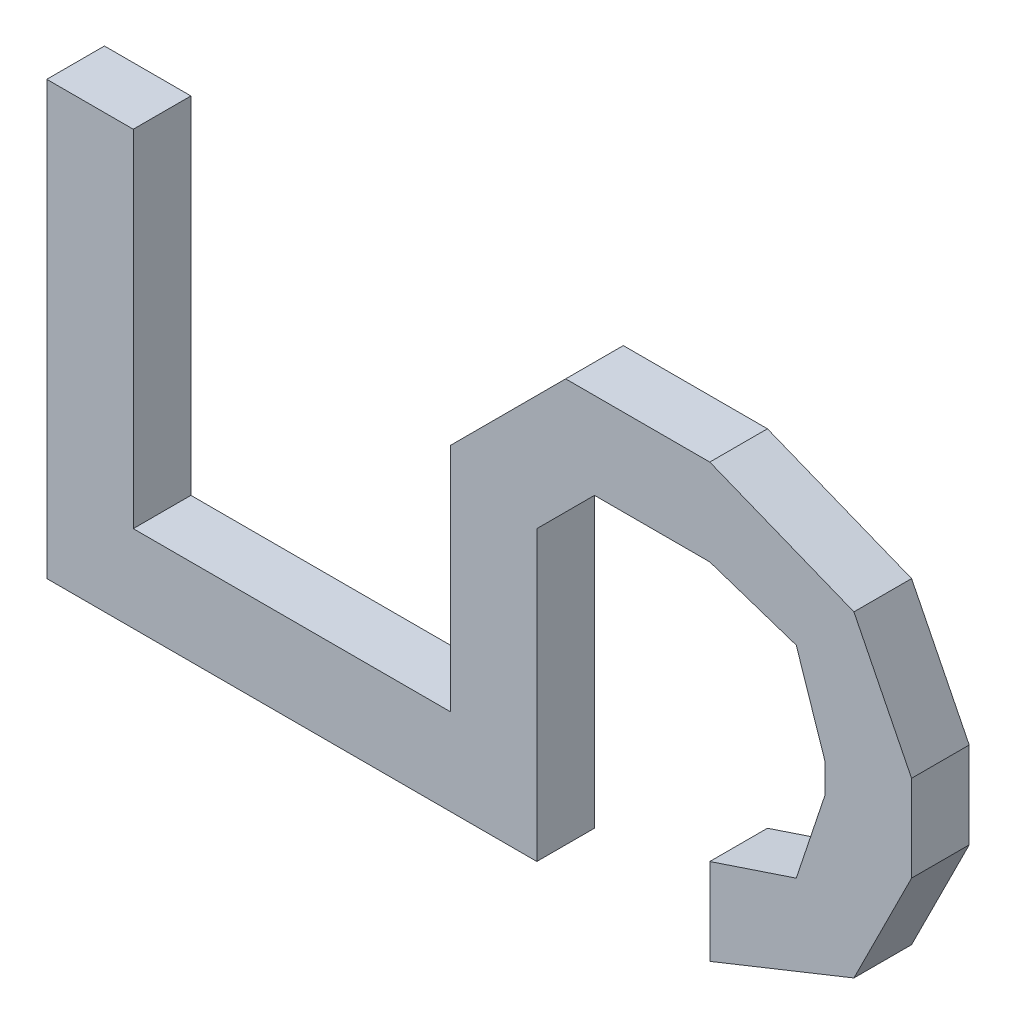
ISO-10303-21;
HEADER;
FILE_DESCRIPTION(('STEP AP214'),'2;1');
FILE_NAME('part.step','',(''),(''),'','','');
FILE_SCHEMA(('AUTOMOTIVE_DESIGN { 1 0 10303 214 1 1 1 1 }'));
ENDSEC;
DATA;
#1=APPLICATION_CONTEXT('core data for automotive mechanical design processes');
#2=APPLICATION_PROTOCOL_DEFINITION('international standard','automotive_design',2000,#1);
#3=PRODUCT_CONTEXT('',#1,'mechanical');
#4=PRODUCT('Part','Part','',(#3));
#5=PRODUCT_RELATED_PRODUCT_CATEGORY('part','',(#4));
#6=PRODUCT_DEFINITION_FORMATION('','',#4);
#7=PRODUCT_DEFINITION_CONTEXT('part definition',#1,'design');
#8=PRODUCT_DEFINITION('design','',#6,#7);
#9=PRODUCT_DEFINITION_SHAPE('','',#8);
#10=(LENGTH_UNIT() NAMED_UNIT(*) SI_UNIT(.MILLI.,.METRE.));
#11=(NAMED_UNIT(*) PLANE_ANGLE_UNIT() SI_UNIT($,.RADIAN.));
#12=(NAMED_UNIT(*) SI_UNIT($,.STERADIAN.) SOLID_ANGLE_UNIT());
#13=UNCERTAINTY_MEASURE_WITH_UNIT(LENGTH_MEASURE(1.E-05),#10,'distance_accuracy_value','');
#14=(GEOMETRIC_REPRESENTATION_CONTEXT(3) GLOBAL_UNCERTAINTY_ASSIGNED_CONTEXT((#13)) GLOBAL_UNIT_ASSIGNED_CONTEXT((#10,
#11,#12)) REPRESENTATION_CONTEXT('',''));
#15=CARTESIAN_POINT('',(0.,0.,0.));
#16=DIRECTION('',(0.,0.,1.));
#17=DIRECTION('',(1.,0.,0.));
#18=AXIS2_PLACEMENT_3D('',#15,#16,#17);
#19=CARTESIAN_POINT('',(-0.1524,0.09524999999999,0.0254));
#20=DIRECTION('',(0.,0.,-1.));
#21=DIRECTION('',(-1.,0.,0.));
#22=AXIS2_PLACEMENT_3D('',#19,#20,#21);
#23=PLANE('',#22);
#24=DIRECTION('',(0.,1.,0.));
#25=VECTOR('',#24,1.);
#26=CARTESIAN_POINT('',(-0.1905,0.09524999999999,0.0254));
#27=LINE('',#26,#25);
#28=CARTESIAN_POINT('',(-0.1905,0.09524999999999,0.0254));
#29=VERTEX_POINT('',#28);
#30=CARTESIAN_POINT('',(-0.1905,-0.09524999999999,0.0254));
#31=VERTEX_POINT('',#30);
#32=EDGE_CURVE('E256',#29,#31,#27,.F.);
#33=ORIENTED_EDGE('',*,*,#32,.T.);
#34=DIRECTION('',(1.,0.,0.));
#35=VECTOR('',#34,1.);
#36=CARTESIAN_POINT('',(-0.1905,-0.09524999999999,0.0254));
#37=LINE('',#36,#35);
#38=CARTESIAN_POINT('',(0.0254,-0.09524999999999,0.0254));
#39=VERTEX_POINT('',#38);
#40=EDGE_CURVE('E252',#31,#39,#37,.T.);
#41=ORIENTED_EDGE('',*,*,#40,.T.);
#42=DIRECTION('',(0.,1.,0.));
#43=VECTOR('',#42,1.);
#44=CARTESIAN_POINT('',(0.0254,-0.09524999999999,0.0254));
#45=LINE('',#44,#43);
#46=CARTESIAN_POINT('',(0.0254,0.03174999999999,0.0254));
#47=VERTEX_POINT('',#46);
#48=EDGE_CURVE('E248',#39,#47,#45,.T.);
#49=ORIENTED_EDGE('',*,*,#48,.T.);
#50=DIRECTION('',(-0.707106781186048,-0.707106781187048,0.));
#51=VECTOR('',#50,1.);
#52=CARTESIAN_POINT('',(0.0254,0.03174999999999,0.0254));
#53=LINE('',#52,#51);
#54=CARTESIAN_POINT('',(0.0507999999999981,0.057150000000012,0.0254));
#55=VERTEX_POINT('',#54);
#56=EDGE_CURVE('E244',#47,#55,#53,.F.);
#57=ORIENTED_EDGE('',*,*,#56,.T.);
#58=DIRECTION('',(1.,0.,0.));
#59=VECTOR('',#58,1.);
#60=CARTESIAN_POINT('',(0.0508,0.05715000000001,0.0254));
#61=LINE('',#60,#59);
#62=CARTESIAN_POINT('',(0.1016,0.05715000000001,0.0254));
#63=VERTEX_POINT('',#62);
#64=EDGE_CURVE('E240',#55,#63,#61,.T.);
#65=ORIENTED_EDGE('',*,*,#64,.T.);
#66=DIRECTION('',(-0.948683298050514,0.316227766016838,0.));
#67=VECTOR('',#66,1.);
#68=CARTESIAN_POINT('',(0.1016,0.05715000000001,0.0254));
#69=LINE('',#68,#67);
#70=CARTESIAN_POINT('',(0.1397,0.04445000000001,0.0254));
#71=VERTEX_POINT('',#70);
#72=EDGE_CURVE('E236',#63,#71,#69,.F.);
#73=ORIENTED_EDGE('',*,*,#72,.T.);
#74=DIRECTION('',(-0.316227766016838,0.948683298050514,0.));
#75=VECTOR('',#74,1.);
#76=CARTESIAN_POINT('',(0.1397,0.04445000000001,0.0254));
#77=LINE('',#76,#75);
#78=CARTESIAN_POINT('',(0.152400000000001,0.00634999999999823,0.0254));
#79=VERTEX_POINT('',#78);
#80=EDGE_CURVE('E232',#71,#79,#77,.F.);
#81=ORIENTED_EDGE('',*,*,#80,.T.);
#82=DIRECTION('',(0.,1.,0.));
#83=VECTOR('',#82,1.);
#84=CARTESIAN_POINT('',(0.1524,0.006349999999998,0.0254));
#85=LINE('',#84,#83);
#86=CARTESIAN_POINT('',(0.1524,-0.00634999999999801,0.0254));
#87=VERTEX_POINT('',#86);
#88=EDGE_CURVE('E228',#79,#87,#85,.F.);
#89=ORIENTED_EDGE('',*,*,#88,.T.);
#90=DIRECTION('',(0.316227766016838,0.948683298050514,0.));
#91=VECTOR('',#90,1.);
#92=CARTESIAN_POINT('',(0.1524,-0.006349999999998,0.0254));
#93=LINE('',#92,#91);
#94=CARTESIAN_POINT('',(0.139699999999999,-0.0444500000000097,0.0254));
#95=VERTEX_POINT('',#94);
#96=EDGE_CURVE('E224',#87,#95,#93,.F.);
#97=ORIENTED_EDGE('',*,*,#96,.T.);
#98=DIRECTION('',(0.948683298050514,0.316227766016838,0.));
#99=VECTOR('',#98,1.);
#100=CARTESIAN_POINT('',(0.1397,-0.04445000000001,0.0254));
#101=LINE('',#100,#99);
#102=CARTESIAN_POINT('',(0.1016,-0.05715000000001,0.0254));
#103=VERTEX_POINT('',#102);
#104=EDGE_CURVE('E220',#95,#103,#101,.F.);
#105=ORIENTED_EDGE('',*,*,#104,.T.);
#106=DIRECTION('',(0.,1.,0.));
#107=VECTOR('',#106,1.);
#108=CARTESIAN_POINT('',(0.1016,-0.05715000000001,0.0254));
#109=LINE('',#108,#107);
#110=CARTESIAN_POINT('',(0.1016,-0.09524999999999,0.0254));
#111=VERTEX_POINT('',#110);
#112=EDGE_CURVE('E216',#103,#111,#109,.F.);
#113=ORIENTED_EDGE('',*,*,#112,.T.);
#114=DIRECTION('',(-0.928476690885259,-0.371390676354104,0.));
#115=VECTOR('',#114,1.);
#116=CARTESIAN_POINT('',(0.1016,-0.09524999999999,0.0254));
#117=LINE('',#116,#115);
#118=CARTESIAN_POINT('',(0.165099999999999,-0.0698499999999978,0.0254));
#119=VERTEX_POINT('',#118);
#120=EDGE_CURVE('E212',#111,#119,#117,.F.);
#121=ORIENTED_EDGE('',*,*,#120,.T.);
#122=DIRECTION('',(-0.447213595499958,-0.894427190999916,0.));
#123=VECTOR('',#122,1.);
#124=CARTESIAN_POINT('',(0.1651,-0.06985,0.0254));
#125=LINE('',#124,#123);
#126=CARTESIAN_POINT('',(0.190500000000001,-0.0190499999999905,0.0254));
#127=VERTEX_POINT('',#126);
#128=EDGE_CURVE('E208',#119,#127,#125,.F.);
#129=ORIENTED_EDGE('',*,*,#128,.T.);
#130=DIRECTION('',(0.,1.,0.));
#131=VECTOR('',#130,1.);
#132=CARTESIAN_POINT('',(0.1905,-0.01904999999999,0.0254));
#133=LINE('',#132,#131);
#134=CARTESIAN_POINT('',(0.1905,0.01904999999999,0.0254));
#135=VERTEX_POINT('',#134);
#136=EDGE_CURVE('E204',#127,#135,#133,.T.);
#137=ORIENTED_EDGE('',*,*,#136,.T.);
#138=DIRECTION('',(0.447213595499958,-0.894427190999916,0.));
#139=VECTOR('',#138,1.);
#140=CARTESIAN_POINT('',(0.1905,0.01904999999999,0.0254));
#141=LINE('',#140,#139);
#142=CARTESIAN_POINT('',(0.165099999999999,0.0698499999999995,0.0254));
#143=VERTEX_POINT('',#142);
#144=EDGE_CURVE('E200',#135,#143,#141,.F.);
#145=ORIENTED_EDGE('',*,*,#144,.T.);
#146=DIRECTION('',(0.928476690885259,-0.371390676354104,0.));
#147=VECTOR('',#146,1.);
#148=CARTESIAN_POINT('',(0.1651,0.06985,0.0254));
#149=LINE('',#148,#147);
#150=CARTESIAN_POINT('',(0.101600000000001,0.0952499999999922,0.0254));
#151=VERTEX_POINT('',#150);
#152=EDGE_CURVE('E196',#143,#151,#149,.F.);
#153=ORIENTED_EDGE('',*,*,#152,.T.);
#154=DIRECTION('',(1.,0.,0.));
#155=VECTOR('',#154,1.);
#156=CARTESIAN_POINT('',(0.1016,0.09524999999999,0.0254));
#157=LINE('',#156,#155);
#158=CARTESIAN_POINT('',(0.0381,0.09524999999999,0.0254));
#159=VERTEX_POINT('',#158);
#160=EDGE_CURVE('E192',#151,#159,#157,.F.);
#161=ORIENTED_EDGE('',*,*,#160,.T.);
#162=DIRECTION('',(0.707106781187048,0.707106781186048,0.));
#163=VECTOR('',#162,1.);
#164=CARTESIAN_POINT('',(0.0381,0.09524999999999,0.0254));
#165=LINE('',#164,#163);
#166=CARTESIAN_POINT('',(-0.0127000000000065,0.0444500000000165,0.0254));
#167=VERTEX_POINT('',#166);
#168=EDGE_CURVE('E188',#159,#167,#165,.F.);
#169=ORIENTED_EDGE('',*,*,#168,.T.);
#170=DIRECTION('',(0.,1.,0.));
#171=VECTOR('',#170,1.);
#172=CARTESIAN_POINT('',(-0.0127,0.04445000000001,0.0254));
#173=LINE('',#172,#171);
#174=CARTESIAN_POINT('',(-0.0127,-0.05715000000001,0.0254));
#175=VERTEX_POINT('',#174);
#176=EDGE_CURVE('E164',#167,#175,#173,.F.);
#177=ORIENTED_EDGE('',*,*,#176,.T.);
#178=DIRECTION('',(1.,0.,0.));
#179=VECTOR('',#178,1.);
#180=CARTESIAN_POINT('',(-0.0127,-0.05715000000001,0.0254));
#181=LINE('',#180,#179);
#182=CARTESIAN_POINT('',(-0.1524,-0.05715000000001,0.0254));
#183=VERTEX_POINT('',#182);
#184=EDGE_CURVE('E166',#175,#183,#181,.F.);
#185=ORIENTED_EDGE('',*,*,#184,.T.);
#186=DIRECTION('',(0.,1.,0.));
#187=VECTOR('',#186,1.);
#188=CARTESIAN_POINT('',(-0.1524,-0.05715000000001,0.0254));
#189=LINE('',#188,#187);
#190=CARTESIAN_POINT('',(-0.1524,0.09524999999999,0.0254));
#191=VERTEX_POINT('',#190);
#192=EDGE_CURVE('E20',#183,#191,#189,.T.);
#193=ORIENTED_EDGE('',*,*,#192,.T.);
#194=DIRECTION('',(1.,0.,0.));
#195=VECTOR('',#194,1.);
#196=CARTESIAN_POINT('',(-0.1524,0.09524999999999,0.0254));
#197=LINE('',#196,#195);
#198=EDGE_CURVE('E261',#191,#29,#197,.F.);
#199=ORIENTED_EDGE('',*,*,#198,.T.);
#200=EDGE_LOOP('',(#33,#41,#49,#57,#65,#73,#81,#89,#97,#105,#113,#121,#129,#137,#145,#153,#161,
#169,#177,#185,#193,#199));
#201=FACE_BOUND('',#200,.T.);
#202=ADVANCED_FACE('F17',(#201),#23,.F.);
#203=CARTESIAN_POINT('',(-0.1524,-0.05715000000001,0.));
#204=DIRECTION('',(-1.,0.,0.));
#205=DIRECTION('',(0.,0.,1.));
#206=AXIS2_PLACEMENT_3D('',#203,#204,#205);
#207=PLANE('',#206);
#208=DIRECTION('',(0.,0.,-1.));
#209=VECTOR('',#208,1.);
#210=CARTESIAN_POINT('',(-0.1524,0.09524999999999,0.));
#211=LINE('',#210,#209);
#212=CARTESIAN_POINT('',(-0.1524,0.09524999999999,0.));
#213=VERTEX_POINT('',#212);
#214=EDGE_CURVE('E177',#213,#191,#211,.F.);
#215=ORIENTED_EDGE('',*,*,#214,.T.);
#216=ORIENTED_EDGE('',*,*,#192,.F.);
#217=DIRECTION('',(0.,0.,-1.));
#218=VECTOR('',#217,1.);
#219=CARTESIAN_POINT('',(-0.1524,-0.05715000000001,0.));
#220=LINE('',#219,#218);
#221=CARTESIAN_POINT('',(-0.1524,-0.05715000000001,0.));
#222=VERTEX_POINT('',#221);
#223=EDGE_CURVE('E172',#183,#222,#220,.T.);
#224=ORIENTED_EDGE('',*,*,#223,.T.);
#225=DIRECTION('',(0.,1.,0.));
#226=VECTOR('',#225,1.);
#227=CARTESIAN_POINT('',(-0.1524,0.09524999999999,0.));
#228=LINE('',#227,#226);
#229=EDGE_CURVE('E264',#213,#222,#228,.F.);
#230=ORIENTED_EDGE('',*,*,#229,.F.);
#231=EDGE_LOOP('',(#215,#216,#224,#230));
#232=FACE_BOUND('',#231,.T.);
#233=ADVANCED_FACE('F174',(#232),#207,.F.);
#234=CARTESIAN_POINT('',(-0.0127,-0.05715000000001,0.));
#235=DIRECTION('',(0.,-1.,0.));
#236=DIRECTION('',(0.,0.,-1.));
#237=AXIS2_PLACEMENT_3D('',#234,#235,#236);
#238=PLANE('',#237);
#239=ORIENTED_EDGE('',*,*,#223,.F.);
#240=ORIENTED_EDGE('',*,*,#184,.F.);
#241=DIRECTION('',(0.,0.,-1.));
#242=VECTOR('',#241,1.);
#243=CARTESIAN_POINT('',(-0.0127,-0.05715000000001,0.));
#244=LINE('',#243,#242);
#245=CARTESIAN_POINT('',(-0.0127,-0.05715000000001,0.));
#246=VERTEX_POINT('',#245);
#247=EDGE_CURVE('E184',#175,#246,#244,.T.);
#248=ORIENTED_EDGE('',*,*,#247,.T.);
#249=DIRECTION('',(-1.,0.,0.));
#250=VECTOR('',#249,1.);
#251=CARTESIAN_POINT('',(-0.1524,-0.05715000000001,0.));
#252=LINE('',#251,#250);
#253=EDGE_CURVE('E181',#222,#246,#252,.F.);
#254=ORIENTED_EDGE('',*,*,#253,.F.);
#255=EDGE_LOOP('',(#239,#240,#248,#254));
#256=FACE_BOUND('',#255,.T.);
#257=ADVANCED_FACE('F179',(#256),#238,.F.);
#258=CARTESIAN_POINT('',(-0.0127,0.04445000000001,0.));
#259=DIRECTION('',(1.,0.,0.));
#260=DIRECTION('',(0.,0.,-1.));
#261=AXIS2_PLACEMENT_3D('',#258,#259,#260);
#262=PLANE('',#261);
#263=ORIENTED_EDGE('',*,*,#247,.F.);
#264=ORIENTED_EDGE('',*,*,#176,.F.);
#265=DIRECTION('',(0.,0.,1.));
#266=VECTOR('',#265,1.);
#267=CARTESIAN_POINT('',(-0.0127000000000259,0.0444500000000359,0.));
#268=LINE('',#267,#266);
#269=CARTESIAN_POINT('',(-0.0127000000000065,0.0444500000000165,0.));
#270=VERTEX_POINT('',#269);
#271=EDGE_CURVE('E190',#167,#270,#268,.F.);
#272=ORIENTED_EDGE('',*,*,#271,.T.);
#273=DIRECTION('',(0.,1.,0.));
#274=VECTOR('',#273,1.);
#275=CARTESIAN_POINT('',(-0.0127,0.09524999999999,0.));
#276=LINE('',#275,#274);
#277=EDGE_CURVE('E267',#246,#270,#276,.T.);
#278=ORIENTED_EDGE('',*,*,#277,.F.);
#279=EDGE_LOOP('',(#263,#264,#272,#278));
#280=FACE_BOUND('',#279,.T.);
#281=ADVANCED_FACE('F412',(#280),#262,.F.);
#282=CARTESIAN_POINT('',(0.0381,0.09524999999999,0.));
#283=DIRECTION('',(0.707106781186048,-0.707106781187048,0.));
#284=DIRECTION('',(0.707106781187048,0.707106781186048,0.));
#285=AXIS2_PLACEMENT_3D('',#282,#283,#284);
#286=PLANE('',#285);
#287=ORIENTED_EDGE('',*,*,#271,.F.);
#288=ORIENTED_EDGE('',*,*,#168,.F.);
#289=DIRECTION('',(0.,0.,-1.));
#290=VECTOR('',#289,1.);
#291=CARTESIAN_POINT('',(0.0381,0.09524999999999,0.));
#292=LINE('',#291,#290);
#293=CARTESIAN_POINT('',(0.0381,0.09524999999999,0.));
#294=VERTEX_POINT('',#293);
#295=EDGE_CURVE('E194',#159,#294,#292,.T.);
#296=ORIENTED_EDGE('',*,*,#295,.T.);
#297=DIRECTION('',(0.707106781186687,0.707106781186408,0.));
#298=VECTOR('',#297,1.);
#299=CARTESIAN_POINT('',(-0.0127,0.04445000000001,0.));
#300=LINE('',#299,#298);
#301=EDGE_CURVE('E270',#270,#294,#300,.T.);
#302=ORIENTED_EDGE('',*,*,#301,.F.);
#303=EDGE_LOOP('',(#287,#288,#296,#302));
#304=FACE_BOUND('',#303,.T.);
#305=ADVANCED_FACE('F410',(#304),#286,.F.);
#306=CARTESIAN_POINT('',(0.1016,0.09524999999999,0.));
#307=DIRECTION('',(0.,-1.,0.));
#308=DIRECTION('',(0.,0.,-1.));
#309=AXIS2_PLACEMENT_3D('',#306,#307,#308);
#310=PLANE('',#309);
#311=ORIENTED_EDGE('',*,*,#295,.F.);
#312=ORIENTED_EDGE('',*,*,#160,.F.);
#313=DIRECTION('',(0.,0.,1.));
#314=VECTOR('',#313,1.);
#315=CARTESIAN_POINT('',(0.101600000000003,0.0952499999999986,0.));
#316=LINE('',#315,#314);
#317=CARTESIAN_POINT('',(0.101600000000001,0.0952499999999921,0.));
#318=VERTEX_POINT('',#317);
#319=EDGE_CURVE('E198',#151,#318,#316,.F.);
#320=ORIENTED_EDGE('',*,*,#319,.T.);
#321=DIRECTION('',(-1.,0.,0.));
#322=VECTOR('',#321,1.);
#323=CARTESIAN_POINT('',(-0.1524,0.09524999999999,0.));
#324=LINE('',#323,#322);
#325=EDGE_CURVE('E273',#294,#318,#324,.F.);
#326=ORIENTED_EDGE('',*,*,#325,.F.);
#327=EDGE_LOOP('',(#311,#312,#320,#326));
#328=FACE_BOUND('',#327,.T.);
#329=ADVANCED_FACE('F405',(#328),#310,.F.);
#330=CARTESIAN_POINT('',(0.1651,0.06985,0.));
#331=DIRECTION('',(-0.371390676354104,-0.928476690885259,0.));
#332=DIRECTION('',(0.928476690885259,-0.371390676354104,0.));
#333=AXIS2_PLACEMENT_3D('',#330,#331,#332);
#334=PLANE('',#333);
#335=ORIENTED_EDGE('',*,*,#319,.F.);
#336=ORIENTED_EDGE('',*,*,#152,.F.);
#337=DIRECTION('',(0.,0.,1.));
#338=VECTOR('',#337,1.);
#339=CARTESIAN_POINT('',(0.165099999999996,0.069849999999998,0.));
#340=LINE('',#339,#338);
#341=CARTESIAN_POINT('',(0.165099999999999,0.0698499999999995,0.));
#342=VERTEX_POINT('',#341);
#343=EDGE_CURVE('E202',#143,#342,#340,.F.);
#344=ORIENTED_EDGE('',*,*,#343,.T.);
#345=DIRECTION('',(0.92847669088531,-0.371390676353978,0.));
#346=VECTOR('',#345,1.);
#347=CARTESIAN_POINT('',(0.1016,0.09524999999999,0.));
#348=LINE('',#347,#346);
#349=EDGE_CURVE('E276',#318,#342,#348,.T.);
#350=ORIENTED_EDGE('',*,*,#349,.F.);
#351=EDGE_LOOP('',(#335,#336,#344,#350));
#352=FACE_BOUND('',#351,.T.);
#353=ADVANCED_FACE('F400',(#352),#334,.F.);
#354=CARTESIAN_POINT('',(0.1905,0.01904999999999,0.));
#355=DIRECTION('',(-0.894427190999916,-0.447213595499958,0.));
#356=DIRECTION('',(0.447213595499958,-0.894427190999916,0.));
#357=AXIS2_PLACEMENT_3D('',#354,#355,#356);
#358=PLANE('',#357);
#359=ORIENTED_EDGE('',*,*,#343,.F.);
#360=ORIENTED_EDGE('',*,*,#144,.F.);
#361=DIRECTION('',(0.,0.,1.));
#362=VECTOR('',#361,1.);
#363=CARTESIAN_POINT('',(0.1905,0.01904999999999,0.));
#364=LINE('',#363,#362);
#365=CARTESIAN_POINT('',(0.1905,0.01904999999999,0.));
#366=VERTEX_POINT('',#365);
#367=EDGE_CURVE('E206',#135,#366,#364,.F.);
#368=ORIENTED_EDGE('',*,*,#367,.T.);
#369=DIRECTION('',(0.447213595499888,-0.894427190999951,0.));
#370=VECTOR('',#369,1.);
#371=CARTESIAN_POINT('',(0.1651,0.06985,0.));
#372=LINE('',#371,#370);
#373=EDGE_CURVE('E279',#342,#366,#372,.T.);
#374=ORIENTED_EDGE('',*,*,#373,.F.);
#375=EDGE_LOOP('',(#359,#360,#368,#374));
#376=FACE_BOUND('',#375,.T.);
#377=ADVANCED_FACE('F395',(#376),#358,.F.);
#378=CARTESIAN_POINT('',(0.1905,-0.01904999999999,0.));
#379=DIRECTION('',(-1.,0.,0.));
#380=DIRECTION('',(0.,0.,1.));
#381=AXIS2_PLACEMENT_3D('',#378,#379,#380);
#382=PLANE('',#381);
#383=ORIENTED_EDGE('',*,*,#367,.F.);
#384=ORIENTED_EDGE('',*,*,#136,.F.);
#385=DIRECTION('',(0.,0.,1.));
#386=VECTOR('',#385,1.);
#387=CARTESIAN_POINT('',(0.190500000000004,-0.019049999999992,0.));
#388=LINE('',#387,#386);
#389=CARTESIAN_POINT('',(0.190500000000001,-0.0190499999999905,0.));
#390=VERTEX_POINT('',#389);
#391=EDGE_CURVE('E210',#127,#390,#388,.F.);
#392=ORIENTED_EDGE('',*,*,#391,.T.);
#393=DIRECTION('',(0.,1.,0.));
#394=VECTOR('',#393,1.);
#395=CARTESIAN_POINT('',(0.1905,0.09524999999999,0.));
#396=LINE('',#395,#394);
#397=EDGE_CURVE('E282',#366,#390,#396,.F.);
#398=ORIENTED_EDGE('',*,*,#397,.F.);
#399=EDGE_LOOP('',(#383,#384,#392,#398));
#400=FACE_BOUND('',#399,.T.);
#401=ADVANCED_FACE('F390',(#400),#382,.F.);
#402=CARTESIAN_POINT('',(0.1651,-0.06985,0.));
#403=DIRECTION('',(-0.894427190999916,0.447213595499958,0.));
#404=DIRECTION('',(-0.447213595499958,-0.894427190999916,0.));
#405=AXIS2_PLACEMENT_3D('',#402,#403,#404);
#406=PLANE('',#405);
#407=ORIENTED_EDGE('',*,*,#391,.F.);
#408=ORIENTED_EDGE('',*,*,#128,.F.);
#409=DIRECTION('',(0.,0.,1.));
#410=VECTOR('',#409,1.);
#411=CARTESIAN_POINT('',(0.165099999999997,-0.0698499999999914,0.));
#412=LINE('',#411,#410);
#413=CARTESIAN_POINT('',(0.165099999999999,-0.0698499999999978,0.));
#414=VERTEX_POINT('',#413);
#415=EDGE_CURVE('E214',#119,#414,#412,.F.);
#416=ORIENTED_EDGE('',*,*,#415,.T.);
#417=DIRECTION('',(-0.447213595499888,-0.894427190999951,0.));
#418=VECTOR('',#417,1.);
#419=CARTESIAN_POINT('',(0.1905,-0.01904999999999,0.));
#420=LINE('',#419,#418);
#421=EDGE_CURVE('E285',#390,#414,#420,.T.);
#422=ORIENTED_EDGE('',*,*,#421,.F.);
#423=EDGE_LOOP('',(#407,#408,#416,#422));
#424=FACE_BOUND('',#423,.T.);
#425=ADVANCED_FACE('F385',(#424),#406,.F.);
#426=CARTESIAN_POINT('',(0.1016,-0.09524999999999,0.));
#427=DIRECTION('',(-0.371390676354104,0.928476690885259,0.));
#428=DIRECTION('',(-0.928476690885259,-0.371390676354104,0.));
#429=AXIS2_PLACEMENT_3D('',#426,#427,#428);
#430=PLANE('',#429);
#431=ORIENTED_EDGE('',*,*,#415,.F.);
#432=ORIENTED_EDGE('',*,*,#120,.F.);
#433=DIRECTION('',(0.,0.,-1.));
#434=VECTOR('',#433,1.);
#435=CARTESIAN_POINT('',(0.1016,-0.09524999999999,0.));
#436=LINE('',#435,#434);
#437=CARTESIAN_POINT('',(0.1016,-0.09524999999999,0.));
#438=VERTEX_POINT('',#437);
#439=EDGE_CURVE('E218',#111,#438,#436,.T.);
#440=ORIENTED_EDGE('',*,*,#439,.T.);
#441=DIRECTION('',(-0.92847669088531,-0.371390676353978,0.));
#442=VECTOR('',#441,1.);
#443=CARTESIAN_POINT('',(0.1651,-0.06985,0.));
#444=LINE('',#443,#442);
#445=EDGE_CURVE('E288',#414,#438,#444,.T.);
#446=ORIENTED_EDGE('',*,*,#445,.F.);
#447=EDGE_LOOP('',(#431,#432,#440,#446));
#448=FACE_BOUND('',#447,.T.);
#449=ADVANCED_FACE('F380',(#448),#430,.F.);
#450=CARTESIAN_POINT('',(0.1016,-0.05715000000001,0.));
#451=DIRECTION('',(1.,0.,0.));
#452=DIRECTION('',(0.,0.,-1.));
#453=AXIS2_PLACEMENT_3D('',#450,#451,#452);
#454=PLANE('',#453);
#455=ORIENTED_EDGE('',*,*,#439,.F.);
#456=ORIENTED_EDGE('',*,*,#112,.F.);
#457=DIRECTION('',(0.,0.,1.));
#458=VECTOR('',#457,1.);
#459=CARTESIAN_POINT('',(0.1016,-0.05715000000001,0.));
#460=LINE('',#459,#458);
#461=CARTESIAN_POINT('',(0.1016,-0.05715000000001,0.));
#462=VERTEX_POINT('',#461);
#463=EDGE_CURVE('E222',#103,#462,#460,.F.);
#464=ORIENTED_EDGE('',*,*,#463,.T.);
#465=DIRECTION('',(0.,1.,0.));
#466=VECTOR('',#465,1.);
#467=CARTESIAN_POINT('',(0.1016,0.09524999999999,0.));
#468=LINE('',#467,#466);
#469=EDGE_CURVE('E291',#438,#462,#468,.T.);
#470=ORIENTED_EDGE('',*,*,#469,.F.);
#471=EDGE_LOOP('',(#455,#456,#464,#470));
#472=FACE_BOUND('',#471,.T.);
#473=ADVANCED_FACE('F375',(#472),#454,.F.);
#474=CARTESIAN_POINT('',(0.1397,-0.04445000000001,0.));
#475=DIRECTION('',(0.316227766016838,-0.948683298050514,0.));
#476=DIRECTION('',(0.948683298050514,0.316227766016838,0.));
#477=AXIS2_PLACEMENT_3D('',#474,#475,#476);
#478=PLANE('',#477);
#479=ORIENTED_EDGE('',*,*,#463,.F.);
#480=ORIENTED_EDGE('',*,*,#104,.F.);
#481=DIRECTION('',(0.,0.,1.));
#482=VECTOR('',#481,1.);
#483=CARTESIAN_POINT('',(0.139699999999996,-0.0444500000000088,0.));
#484=LINE('',#483,#482);
#485=CARTESIAN_POINT('',(0.139699999999999,-0.0444500000000097,0.));
#486=VERTEX_POINT('',#485);
#487=EDGE_CURVE('E226',#95,#486,#484,.F.);
#488=ORIENTED_EDGE('',*,*,#487,.T.);
#489=DIRECTION('',(0.948683298050514,0.316227766016838,0.));
#490=VECTOR('',#489,1.);
#491=CARTESIAN_POINT('',(0.1016,-0.05715000000001,0.));
#492=LINE('',#491,#490);
#493=EDGE_CURVE('E294',#462,#486,#492,.T.);
#494=ORIENTED_EDGE('',*,*,#493,.F.);
#495=EDGE_LOOP('',(#479,#480,#488,#494));
#496=FACE_BOUND('',#495,.T.);
#497=ADVANCED_FACE('F370',(#496),#478,.F.);
#498=CARTESIAN_POINT('',(0.1524,-0.006349999999998,0.));
#499=DIRECTION('',(0.948683298050514,-0.316227766016838,0.));
#500=DIRECTION('',(0.316227766016838,0.948683298050514,0.));
#501=AXIS2_PLACEMENT_3D('',#498,#499,#500);
#502=PLANE('',#501);
#503=ORIENTED_EDGE('',*,*,#487,.F.);
#504=ORIENTED_EDGE('',*,*,#96,.F.);
#505=DIRECTION('',(0.,0.,-1.));
#506=VECTOR('',#505,1.);
#507=CARTESIAN_POINT('',(0.1524,-0.006349999999998,0.));
#508=LINE('',#507,#506);
#509=CARTESIAN_POINT('',(0.1524,-0.00634999999999801,0.));
#510=VERTEX_POINT('',#509);
#511=EDGE_CURVE('E230',#87,#510,#508,.T.);
#512=ORIENTED_EDGE('',*,*,#511,.T.);
#513=DIRECTION('',(0.316227766016749,0.948683298050543,0.));
#514=VECTOR('',#513,1.);
#515=CARTESIAN_POINT('',(0.1397,-0.04445000000001,0.));
#516=LINE('',#515,#514);
#517=EDGE_CURVE('E297',#486,#510,#516,.T.);
#518=ORIENTED_EDGE('',*,*,#517,.F.);
#519=EDGE_LOOP('',(#503,#504,#512,#518));
#520=FACE_BOUND('',#519,.T.);
#521=ADVANCED_FACE('F365',(#520),#502,.F.);
#522=CARTESIAN_POINT('',(0.1524,0.006349999999998,0.));
#523=DIRECTION('',(1.,0.,0.));
#524=DIRECTION('',(0.,0.,-1.));
#525=AXIS2_PLACEMENT_3D('',#522,#523,#524);
#526=PLANE('',#525);
#527=ORIENTED_EDGE('',*,*,#511,.F.);
#528=ORIENTED_EDGE('',*,*,#88,.F.);
#529=DIRECTION('',(0.,0.,1.));
#530=VECTOR('',#529,1.);
#531=CARTESIAN_POINT('',(0.152400000000004,0.00634999999999918,0.));
#532=LINE('',#531,#530);
#533=CARTESIAN_POINT('',(0.152400000000001,0.00634999999999826,0.));
#534=VERTEX_POINT('',#533);
#535=EDGE_CURVE('E234',#79,#534,#532,.F.);
#536=ORIENTED_EDGE('',*,*,#535,.T.);
#537=DIRECTION('',(0.,1.,0.));
#538=VECTOR('',#537,1.);
#539=CARTESIAN_POINT('',(0.1524,0.09524999999999,0.));
#540=LINE('',#539,#538);
#541=EDGE_CURVE('E300',#510,#534,#540,.T.);
#542=ORIENTED_EDGE('',*,*,#541,.F.);
#543=EDGE_LOOP('',(#527,#528,#536,#542));
#544=FACE_BOUND('',#543,.T.);
#545=ADVANCED_FACE('F360',(#544),#526,.F.);
#546=CARTESIAN_POINT('',(0.1397,0.04445000000001,0.));
#547=DIRECTION('',(0.948683298050514,0.316227766016838,0.));
#548=DIRECTION('',(-0.316227766016838,0.948683298050514,0.));
#549=AXIS2_PLACEMENT_3D('',#546,#547,#548);
#550=PLANE('',#549);
#551=ORIENTED_EDGE('',*,*,#535,.F.);
#552=ORIENTED_EDGE('',*,*,#80,.F.);
#553=DIRECTION('',(0.,0.,1.));
#554=VECTOR('',#553,1.);
#555=CARTESIAN_POINT('',(0.1397,0.04445000000001,0.));
#556=LINE('',#555,#554);
#557=CARTESIAN_POINT('',(0.1397,0.04445000000001,0.));
#558=VERTEX_POINT('',#557);
#559=EDGE_CURVE('E238',#71,#558,#556,.F.);
#560=ORIENTED_EDGE('',*,*,#559,.T.);
#561=DIRECTION('',(-0.316227766016749,0.948683298050543,0.));
#562=VECTOR('',#561,1.);
#563=CARTESIAN_POINT('',(0.1524,0.006349999999998,0.));
#564=LINE('',#563,#562);
#565=EDGE_CURVE('E303',#534,#558,#564,.T.);
#566=ORIENTED_EDGE('',*,*,#565,.F.);
#567=EDGE_LOOP('',(#551,#552,#560,#566));
#568=FACE_BOUND('',#567,.T.);
#569=ADVANCED_FACE('F355',(#568),#550,.F.);
#570=CARTESIAN_POINT('',(0.1016,0.05715000000001,0.));
#571=DIRECTION('',(0.316227766016838,0.948683298050514,0.));
#572=DIRECTION('',(-0.948683298050514,0.316227766016838,0.));
#573=AXIS2_PLACEMENT_3D('',#570,#571,#572);
#574=PLANE('',#573);
#575=ORIENTED_EDGE('',*,*,#559,.F.);
#576=ORIENTED_EDGE('',*,*,#72,.F.);
#577=DIRECTION('',(0.,0.,1.));
#578=VECTOR('',#577,1.);
#579=CARTESIAN_POINT('',(0.1016,0.05715000000001,0.));
#580=LINE('',#579,#578);
#581=CARTESIAN_POINT('',(0.1016,0.05715000000001,0.));
#582=VERTEX_POINT('',#581);
#583=EDGE_CURVE('E242',#63,#582,#580,.F.);
#584=ORIENTED_EDGE('',*,*,#583,.T.);
#585=DIRECTION('',(-0.948683298050514,0.316227766016838,0.));
#586=VECTOR('',#585,1.);
#587=CARTESIAN_POINT('',(0.1397,0.04445000000001,0.));
#588=LINE('',#587,#586);
#589=EDGE_CURVE('E306',#558,#582,#588,.T.);
#590=ORIENTED_EDGE('',*,*,#589,.F.);
#591=EDGE_LOOP('',(#575,#576,#584,#590));
#592=FACE_BOUND('',#591,.T.);
#593=ADVANCED_FACE('F350',(#592),#574,.F.);
#594=CARTESIAN_POINT('',(0.0508,0.05715000000001,0.));
#595=DIRECTION('',(0.,1.,0.));
#596=DIRECTION('',(0.,0.,1.));
#597=AXIS2_PLACEMENT_3D('',#594,#595,#596);
#598=PLANE('',#597);
#599=ORIENTED_EDGE('',*,*,#583,.F.);
#600=ORIENTED_EDGE('',*,*,#64,.F.);
#601=DIRECTION('',(0.,0.,1.));
#602=VECTOR('',#601,1.);
#603=CARTESIAN_POINT('',(0.050799999999992,0.057150000000018,0.));
#604=LINE('',#603,#602);
#605=CARTESIAN_POINT('',(0.050799999999998,0.057150000000012,0.));
#606=VERTEX_POINT('',#605);
#607=EDGE_CURVE('E246',#55,#606,#604,.F.);
#608=ORIENTED_EDGE('',*,*,#607,.T.);
#609=DIRECTION('',(-1.,0.,0.));
#610=VECTOR('',#609,1.);
#611=CARTESIAN_POINT('',(-0.1524,0.05715000000001,0.));
#612=LINE('',#611,#610);
#613=EDGE_CURVE('E309',#582,#606,#612,.T.);
#614=ORIENTED_EDGE('',*,*,#613,.F.);
#615=EDGE_LOOP('',(#599,#600,#608,#614));
#616=FACE_BOUND('',#615,.T.);
#617=ADVANCED_FACE('F345',(#616),#598,.F.);
#618=CARTESIAN_POINT('',(0.0254,0.03174999999999,0.));
#619=DIRECTION('',(-0.707106781187048,0.707106781186048,0.));
#620=DIRECTION('',(-0.707106781186048,-0.707106781187048,0.));
#621=AXIS2_PLACEMENT_3D('',#618,#619,#620);
#622=PLANE('',#621);
#623=ORIENTED_EDGE('',*,*,#607,.F.);
#624=ORIENTED_EDGE('',*,*,#56,.F.);
#625=DIRECTION('',(0.,0.,1.));
#626=VECTOR('',#625,1.);
#627=CARTESIAN_POINT('',(0.0254,0.03174999999999,0.));
#628=LINE('',#627,#626);
#629=CARTESIAN_POINT('',(0.0254,0.03174999999999,0.));
#630=VERTEX_POINT('',#629);
#631=EDGE_CURVE('E250',#47,#630,#628,.F.);
#632=ORIENTED_EDGE('',*,*,#631,.T.);
#633=DIRECTION('',(-0.707106781186269,-0.707106781186826,0.));
#634=VECTOR('',#633,1.);
#635=CARTESIAN_POINT('',(0.0508,0.05715000000001,0.));
#636=LINE('',#635,#634);
#637=EDGE_CURVE('E312',#606,#630,#636,.T.);
#638=ORIENTED_EDGE('',*,*,#637,.F.);
#639=EDGE_LOOP('',(#623,#624,#632,#638));
#640=FACE_BOUND('',#639,.T.);
#641=ADVANCED_FACE('F340',(#640),#622,.F.);
#642=CARTESIAN_POINT('',(0.0254,-0.09524999999999,0.));
#643=DIRECTION('',(-1.,0.,0.));
#644=DIRECTION('',(0.,0.,1.));
#645=AXIS2_PLACEMENT_3D('',#642,#643,#644);
#646=PLANE('',#645);
#647=ORIENTED_EDGE('',*,*,#631,.F.);
#648=ORIENTED_EDGE('',*,*,#48,.F.);
#649=DIRECTION('',(0.,0.,1.));
#650=VECTOR('',#649,1.);
#651=CARTESIAN_POINT('',(0.0254,-0.09524999999999,0.));
#652=LINE('',#651,#650);
#653=CARTESIAN_POINT('',(0.0254,-0.09524999999999,0.));
#654=VERTEX_POINT('',#653);
#655=EDGE_CURVE('E254',#39,#654,#652,.F.);
#656=ORIENTED_EDGE('',*,*,#655,.T.);
#657=DIRECTION('',(0.,1.,0.));
#658=VECTOR('',#657,1.);
#659=CARTESIAN_POINT('',(0.0254,0.09524999999999,0.));
#660=LINE('',#659,#658);
#661=EDGE_CURVE('E315',#630,#654,#660,.F.);
#662=ORIENTED_EDGE('',*,*,#661,.F.);
#663=EDGE_LOOP('',(#647,#648,#656,#662));
#664=FACE_BOUND('',#663,.T.);
#665=ADVANCED_FACE('F335',(#664),#646,.F.);
#666=CARTESIAN_POINT('',(-0.1905,-0.09524999999999,0.));
#667=DIRECTION('',(0.,1.,0.));
#668=DIRECTION('',(0.,0.,1.));
#669=AXIS2_PLACEMENT_3D('',#666,#667,#668);
#670=PLANE('',#669);
#671=ORIENTED_EDGE('',*,*,#655,.F.);
#672=ORIENTED_EDGE('',*,*,#40,.F.);
#673=DIRECTION('',(0.,0.,-1.));
#674=VECTOR('',#673,1.);
#675=CARTESIAN_POINT('',(-0.1905,-0.09524999999999,0.));
#676=LINE('',#675,#674);
#677=CARTESIAN_POINT('',(-0.1905,-0.09524999999999,0.));
#678=VERTEX_POINT('',#677);
#679=EDGE_CURVE('E258',#31,#678,#676,.T.);
#680=ORIENTED_EDGE('',*,*,#679,.T.);
#681=DIRECTION('',(-1.,0.,0.));
#682=VECTOR('',#681,1.);
#683=CARTESIAN_POINT('',(-0.1524,-0.09524999999999,0.));
#684=LINE('',#683,#682);
#685=EDGE_CURVE('E318',#654,#678,#684,.T.);
#686=ORIENTED_EDGE('',*,*,#685,.F.);
#687=EDGE_LOOP('',(#671,#672,#680,#686));
#688=FACE_BOUND('',#687,.T.);
#689=ADVANCED_FACE('F330',(#688),#670,.F.);
#690=CARTESIAN_POINT('',(-0.1905,0.09524999999999,0.));
#691=DIRECTION('',(1.,0.,0.));
#692=DIRECTION('',(0.,0.,-1.));
#693=AXIS2_PLACEMENT_3D('',#690,#691,#692);
#694=PLANE('',#693);
#695=ORIENTED_EDGE('',*,*,#679,.F.);
#696=ORIENTED_EDGE('',*,*,#32,.F.);
#697=DIRECTION('',(0.,0.,-1.));
#698=VECTOR('',#697,1.);
#699=CARTESIAN_POINT('',(-0.1905,0.09524999999999,0.));
#700=LINE('',#699,#698);
#701=CARTESIAN_POINT('',(-0.1905,0.09524999999999,0.));
#702=VERTEX_POINT('',#701);
#703=EDGE_CURVE('E35',#29,#702,#700,.T.);
#704=ORIENTED_EDGE('',*,*,#703,.T.);
#705=DIRECTION('',(0.,1.,0.));
#706=VECTOR('',#705,1.);
#707=CARTESIAN_POINT('',(-0.1905,0.09524999999999,0.));
#708=LINE('',#707,#706);
#709=EDGE_CURVE('E26',#678,#702,#708,.T.);
#710=ORIENTED_EDGE('',*,*,#709,.F.);
#711=EDGE_LOOP('',(#695,#696,#704,#710));
#712=FACE_BOUND('',#711,.T.);
#713=ADVANCED_FACE('F326',(#712),#694,.F.);
#714=CARTESIAN_POINT('',(-0.1524,0.09524999999999,0.));
#715=DIRECTION('',(0.,-1.,0.));
#716=DIRECTION('',(0.,0.,-1.));
#717=AXIS2_PLACEMENT_3D('',#714,#715,#716);
#718=PLANE('',#717);
#719=ORIENTED_EDGE('',*,*,#703,.F.);
#720=ORIENTED_EDGE('',*,*,#198,.F.);
#721=ORIENTED_EDGE('',*,*,#214,.F.);
#722=DIRECTION('',(-1.,0.,0.));
#723=VECTOR('',#722,1.);
#724=CARTESIAN_POINT('',(-0.1524,0.09524999999999,0.));
#725=LINE('',#724,#723);
#726=EDGE_CURVE('E11',#702,#213,#725,.F.);
#727=ORIENTED_EDGE('',*,*,#726,.F.);
#728=EDGE_LOOP('',(#719,#720,#721,#727));
#729=FACE_BOUND('',#728,.T.);
#730=ADVANCED_FACE('F415',(#729),#718,.F.);
#731=CARTESIAN_POINT('',(-0.1524,0.09524999999999,0.));
#732=DIRECTION('',(0.,0.,-1.));
#733=DIRECTION('',(-1.,0.,0.));
#734=AXIS2_PLACEMENT_3D('',#731,#732,#733);
#735=PLANE('',#734);
#736=ORIENTED_EDGE('',*,*,#709,.T.);
#737=ORIENTED_EDGE('',*,*,#726,.T.);
#738=ORIENTED_EDGE('',*,*,#229,.T.);
#739=ORIENTED_EDGE('',*,*,#253,.T.);
#740=ORIENTED_EDGE('',*,*,#277,.T.);
#741=ORIENTED_EDGE('',*,*,#301,.T.);
#742=ORIENTED_EDGE('',*,*,#325,.T.);
#743=ORIENTED_EDGE('',*,*,#349,.T.);
#744=ORIENTED_EDGE('',*,*,#373,.T.);
#745=ORIENTED_EDGE('',*,*,#397,.T.);
#746=ORIENTED_EDGE('',*,*,#421,.T.);
#747=ORIENTED_EDGE('',*,*,#445,.T.);
#748=ORIENTED_EDGE('',*,*,#469,.T.);
#749=ORIENTED_EDGE('',*,*,#493,.T.);
#750=ORIENTED_EDGE('',*,*,#517,.T.);
#751=ORIENTED_EDGE('',*,*,#541,.T.);
#752=ORIENTED_EDGE('',*,*,#565,.T.);
#753=ORIENTED_EDGE('',*,*,#589,.T.);
#754=ORIENTED_EDGE('',*,*,#613,.T.);
#755=ORIENTED_EDGE('',*,*,#637,.T.);
#756=ORIENTED_EDGE('',*,*,#661,.T.);
#757=ORIENTED_EDGE('',*,*,#685,.T.);
#758=EDGE_LOOP('',(#736,#737,#738,#739,#740,#741,#742,#743,#744,#745,#746,#747,#748,#749,#750,
#751,#752,#753,#754,#755,#756,#757));
#759=FACE_BOUND('',#758,.T.);
#760=ADVANCED_FACE('F323',(#759),#735,.T.);
#761=CLOSED_SHELL('',(#202,#233,#257,#281,#305,#329,#353,#377,#401,#425,#449,#473,#497,#521,
#545,#569,#593,#617,#641,#665,#689,#713,#730,#760));
#762=MANIFOLD_SOLID_BREP('B1',#761);
#763=ADVANCED_BREP_SHAPE_REPRESENTATION('',(#18,#762),#14);
#764=SHAPE_DEFINITION_REPRESENTATION(#9,#763);
ENDSEC;
END-ISO-10303-21;
